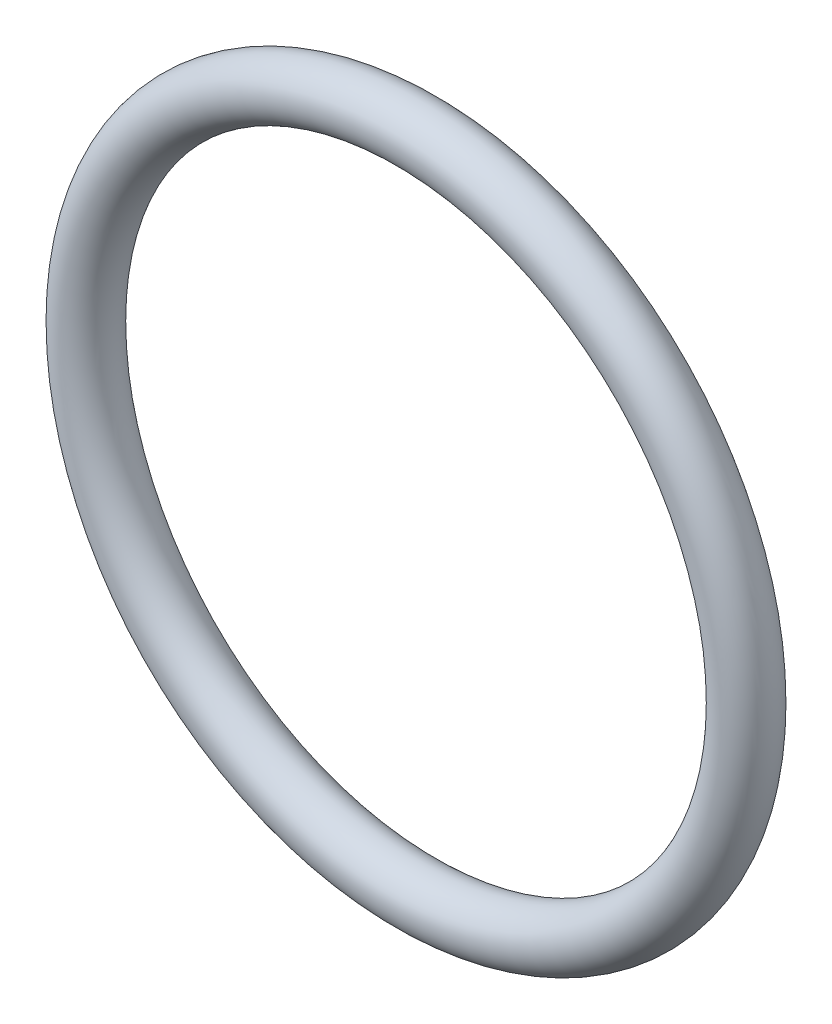
ISO-10303-21;
HEADER;
FILE_DESCRIPTION(('STEP AP214'),'2;1');
FILE_NAME('part.step','',(''),(''),'','','');
FILE_SCHEMA(('AUTOMOTIVE_DESIGN { 1 0 10303 214 1 1 1 1 }'));
ENDSEC;
DATA;
#1=APPLICATION_CONTEXT('core data for automotive mechanical design processes');
#2=APPLICATION_PROTOCOL_DEFINITION('international standard','automotive_design',2000,#1);
#3=PRODUCT_CONTEXT('',#1,'mechanical');
#4=PRODUCT('Part','Part','',(#3));
#5=PRODUCT_RELATED_PRODUCT_CATEGORY('part','',(#4));
#6=PRODUCT_DEFINITION_FORMATION('','',#4);
#7=PRODUCT_DEFINITION_CONTEXT('part definition',#1,'design');
#8=PRODUCT_DEFINITION('design','',#6,#7);
#9=PRODUCT_DEFINITION_SHAPE('','',#8);
#10=(LENGTH_UNIT() NAMED_UNIT(*) SI_UNIT(.MILLI.,.METRE.));
#11=(NAMED_UNIT(*) PLANE_ANGLE_UNIT() SI_UNIT($,.RADIAN.));
#12=(NAMED_UNIT(*) SI_UNIT($,.STERADIAN.) SOLID_ANGLE_UNIT());
#13=UNCERTAINTY_MEASURE_WITH_UNIT(LENGTH_MEASURE(1.E-05),#10,'distance_accuracy_value','');
#14=(GEOMETRIC_REPRESENTATION_CONTEXT(3) GLOBAL_UNCERTAINTY_ASSIGNED_CONTEXT((#13)) GLOBAL_UNIT_ASSIGNED_CONTEXT((#10,
#11,#12)) REPRESENTATION_CONTEXT('',''));
#15=CARTESIAN_POINT('',(0.,0.,0.));
#16=DIRECTION('',(0.,0.,1.));
#17=DIRECTION('',(1.,0.,0.));
#18=AXIS2_PLACEMENT_3D('',#15,#16,#17);
#19=CARTESIAN_POINT('',(0.,0.,2.8306122766608));
#20=DIRECTION('',(0.,0.,-1.));
#21=DIRECTION('',(-1.,0.,0.));
#22=AXIS2_PLACEMENT_3D('',#19,#20,#21);
#23=TOROIDAL_SURFACE('',#22,10.414,0.889);
#24=ADVANCED_FACE('F13',(),#23,.T.);
#25=CLOSED_SHELL('',(#24));
#26=MANIFOLD_SOLID_BREP('B1',#25);
#27=ADVANCED_BREP_SHAPE_REPRESENTATION('',(#18,#26),#14);
#28=SHAPE_DEFINITION_REPRESENTATION(#9,#27);
ENDSEC;
END-ISO-10303-21;
